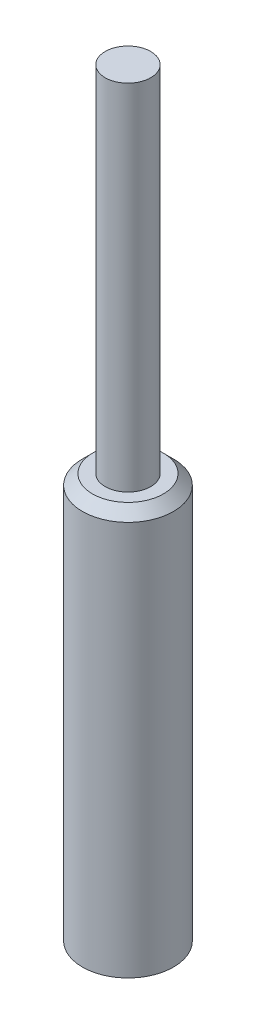
ISO-10303-21;
HEADER;
FILE_DESCRIPTION(('STEP AP214'),'2;1');
FILE_NAME('part.step','',(''),(''),'','','');
FILE_SCHEMA(('AUTOMOTIVE_DESIGN { 1 0 10303 214 1 1 1 1 }'));
ENDSEC;
DATA;
#1=APPLICATION_CONTEXT('core data for automotive mechanical design processes');
#2=APPLICATION_PROTOCOL_DEFINITION('international standard','automotive_design',2000,#1);
#3=PRODUCT_CONTEXT('',#1,'mechanical');
#4=PRODUCT('Part','Part','',(#3));
#5=PRODUCT_RELATED_PRODUCT_CATEGORY('part','',(#4));
#6=PRODUCT_DEFINITION_FORMATION('','',#4);
#7=PRODUCT_DEFINITION_CONTEXT('part definition',#1,'design');
#8=PRODUCT_DEFINITION('design','',#6,#7);
#9=PRODUCT_DEFINITION_SHAPE('','',#8);
#10=(LENGTH_UNIT() NAMED_UNIT(*) SI_UNIT(.MILLI.,.METRE.));
#11=(NAMED_UNIT(*) PLANE_ANGLE_UNIT() SI_UNIT($,.RADIAN.));
#12=(NAMED_UNIT(*) SI_UNIT($,.STERADIAN.) SOLID_ANGLE_UNIT());
#13=UNCERTAINTY_MEASURE_WITH_UNIT(LENGTH_MEASURE(1.E-05),#10,'distance_accuracy_value','');
#14=(GEOMETRIC_REPRESENTATION_CONTEXT(3) GLOBAL_UNCERTAINTY_ASSIGNED_CONTEXT((#13)) GLOBAL_UNIT_ASSIGNED_CONTEXT((#10,
#11,#12)) REPRESENTATION_CONTEXT('',''));
#15=CARTESIAN_POINT('',(0.,0.,0.));
#16=DIRECTION('',(0.,0.,1.));
#17=DIRECTION('',(1.,0.,0.));
#18=AXIS2_PLACEMENT_3D('',#15,#16,#17);
#19=CARTESIAN_POINT('',(0.,0.,0.));
#20=DIRECTION('',(0.,-1.,0.));
#21=DIRECTION('',(0.,0.,-1.));
#22=AXIS2_PLACEMENT_3D('',#19,#20,#21);
#23=PLANE('',#22);
#24=CARTESIAN_POINT('',(0.,0.,0.));
#25=DIRECTION('',(0.,1.,0.));
#26=DIRECTION('',(0.,0.,1.));
#27=AXIS2_PLACEMENT_3D('',#24,#25,#26);
#28=CIRCLE('',#27,0.9);
#29=CARTESIAN_POINT('',(0.,0.,0.9));
#30=VERTEX_POINT('',#29);
#31=EDGE_CURVE('E44',#30,#30,#28,.T.);
#32=ORIENTED_EDGE('',*,*,#31,.F.);
#33=EDGE_LOOP('',(#32));
#34=FACE_BOUND('',#33,.T.);
#35=ADVANCED_FACE('F32',(#34),#23,.T.);
#36=CARTESIAN_POINT('',(0.,0.,0.));
#37=DIRECTION('',(0.,1.,0.));
#38=DIRECTION('',(0.,0.,1.));
#39=AXIS2_PLACEMENT_3D('',#36,#37,#38);
#40=CYLINDRICAL_SURFACE('',#39,0.9);
#41=CARTESIAN_POINT('',(0.,7.8,0.));
#42=DIRECTION('',(0.,1.,0.));
#43=DIRECTION('',(0.,0.,1.));
#44=AXIS2_PLACEMENT_3D('',#41,#42,#43);
#45=CIRCLE('',#44,0.9);
#46=CARTESIAN_POINT('',(0.,7.8,0.9));
#47=VERTEX_POINT('',#46);
#48=EDGE_CURVE('E10',#47,#47,#45,.F.);
#49=ORIENTED_EDGE('',*,*,#48,.T.);
#50=EDGE_LOOP('',(#49));
#51=FACE_BOUND('',#50,.T.);
#52=ORIENTED_EDGE('',*,*,#31,.T.);
#53=EDGE_LOOP('',(#52));
#54=FACE_BOUND('',#53,.T.);
#55=ADVANCED_FACE('F69',(#51,#54),#40,.T.);
#56=CARTESIAN_POINT('',(-0.9,8.,0.));
#57=DIRECTION('',(0.,1.,0.));
#58=DIRECTION('',(0.,0.,1.));
#59=AXIS2_PLACEMENT_3D('',#56,#57,#58);
#60=PLANE('',#59);
#61=CARTESIAN_POINT('',(0.,8.,0.));
#62=DIRECTION('',(0.,1.,0.));
#63=DIRECTION('',(0.,0.,1.));
#64=AXIS2_PLACEMENT_3D('',#61,#62,#63);
#65=CIRCLE('',#64,0.699999999999999);
#66=CARTESIAN_POINT('',(0.,8.,0.699999999999999));
#67=VERTEX_POINT('',#66);
#68=EDGE_CURVE('E40',#67,#67,#65,.T.);
#69=ORIENTED_EDGE('',*,*,#68,.T.);
#70=EDGE_LOOP('',(#69));
#71=FACE_BOUND('',#70,.T.);
#72=CARTESIAN_POINT('',(0.,8.,0.));
#73=DIRECTION('',(0.,1.,0.));
#74=DIRECTION('',(0.,0.,1.));
#75=AXIS2_PLACEMENT_3D('',#72,#73,#74);
#76=CIRCLE('',#75,0.450000000000001);
#77=CARTESIAN_POINT('',(0.,8.,0.450000000000001));
#78=VERTEX_POINT('',#77);
#79=EDGE_CURVE('E48',#78,#78,#76,.T.);
#80=ORIENTED_EDGE('',*,*,#79,.F.);
#81=EDGE_LOOP('',(#80));
#82=FACE_BOUND('',#81,.T.);
#83=ADVANCED_FACE('F61',(#71,#82),#60,.T.);
#84=CARTESIAN_POINT('',(0.,0.,0.));
#85=DIRECTION('',(0.,1.,0.));
#86=DIRECTION('',(0.,0.,1.));
#87=AXIS2_PLACEMENT_3D('',#84,#85,#86);
#88=CYLINDRICAL_SURFACE('',#87,0.450000000000001);
#89=ORIENTED_EDGE('',*,*,#79,.T.);
#90=EDGE_LOOP('',(#89));
#91=FACE_BOUND('',#90,.T.);
#92=CARTESIAN_POINT('',(0.,15.,0.));
#93=DIRECTION('',(0.,1.,0.));
#94=DIRECTION('',(0.,0.,1.));
#95=AXIS2_PLACEMENT_3D('',#92,#93,#94);
#96=CIRCLE('',#95,0.450000000000001);
#97=CARTESIAN_POINT('',(0.,15.,0.450000000000001));
#98=VERTEX_POINT('',#97);
#99=EDGE_CURVE('E53',#98,#98,#96,.T.);
#100=ORIENTED_EDGE('',*,*,#99,.F.);
#101=EDGE_LOOP('',(#100));
#102=FACE_BOUND('',#101,.T.);
#103=ADVANCED_FACE('F59',(#91,#102),#88,.T.);
#104=CARTESIAN_POINT('',(-0.450000000000001,15.,0.));
#105=DIRECTION('',(0.,1.,0.));
#106=DIRECTION('',(0.,0.,1.));
#107=AXIS2_PLACEMENT_3D('',#104,#105,#106);
#108=PLANE('',#107);
#109=ORIENTED_EDGE('',*,*,#99,.T.);
#110=EDGE_LOOP('',(#109));
#111=FACE_BOUND('',#110,.T.);
#112=ADVANCED_FACE('F57',(#111),#108,.T.);
#113=CARTESIAN_POINT('',(0.,8.,0.));
#114=DIRECTION('',(0.,-1.,0.));
#115=DIRECTION('',(0.,0.,-1.));
#116=AXIS2_PLACEMENT_3D('',#113,#114,#115);
#117=CONICAL_SURFACE('',#116,0.699999999999999,0.785398163397449);
#118=ORIENTED_EDGE('',*,*,#48,.F.);
#119=EDGE_LOOP('',(#118));
#120=FACE_BOUND('',#119,.T.);
#121=ORIENTED_EDGE('',*,*,#68,.F.);
#122=EDGE_LOOP('',(#121));
#123=FACE_BOUND('',#122,.T.);
#124=ADVANCED_FACE('F35',(#120,#123),#117,.T.);
#125=CLOSED_SHELL('',(#35,#55,#83,#103,#112,#124));
#126=MANIFOLD_SOLID_BREP('B2',#125);
#127=ADVANCED_BREP_SHAPE_REPRESENTATION('',(#18,#126),#14);
#128=SHAPE_DEFINITION_REPRESENTATION(#9,#127);
ENDSEC;
END-ISO-10303-21;
